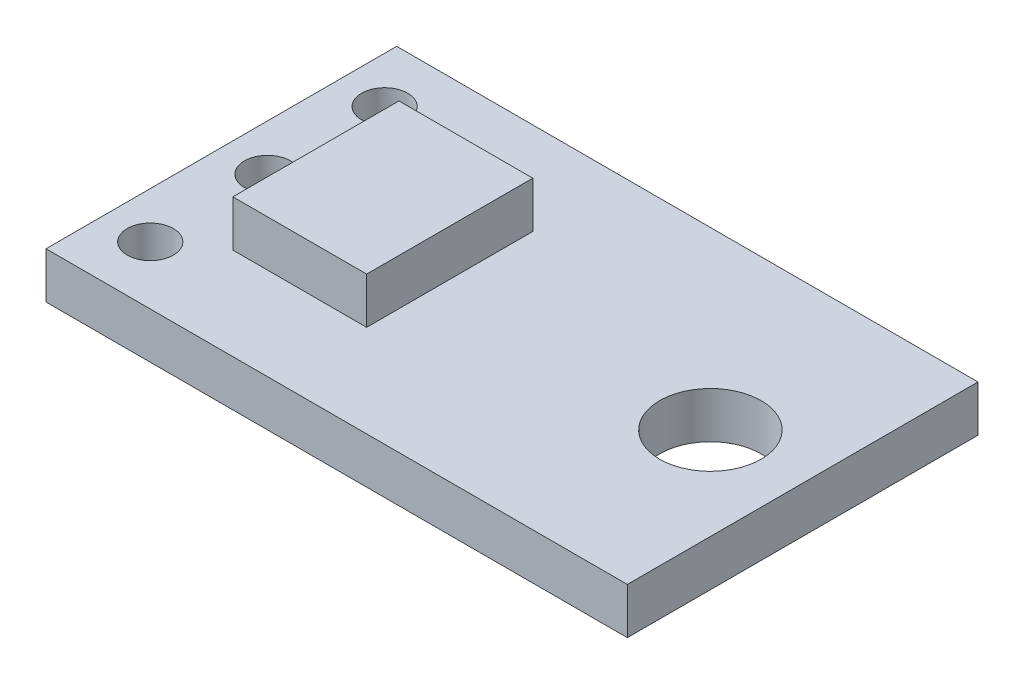
ISO-10303-21;
HEADER;
FILE_DESCRIPTION(('STEP AP214'),'2;1');
FILE_NAME('part.step','',(''),(''),'','','');
FILE_SCHEMA(('AUTOMOTIVE_DESIGN { 1 0 10303 214 1 1 1 1 }'));
ENDSEC;
DATA;
#1=APPLICATION_CONTEXT('core data for automotive mechanical design processes');
#2=APPLICATION_PROTOCOL_DEFINITION('international standard','automotive_design',2000,#1);
#3=PRODUCT_CONTEXT('',#1,'mechanical');
#4=PRODUCT('Part','Part','',(#3));
#5=PRODUCT_RELATED_PRODUCT_CATEGORY('part','',(#4));
#6=PRODUCT_DEFINITION_FORMATION('','',#4);
#7=PRODUCT_DEFINITION_CONTEXT('part definition',#1,'design');
#8=PRODUCT_DEFINITION('design','',#6,#7);
#9=PRODUCT_DEFINITION_SHAPE('','',#8);
#10=(LENGTH_UNIT() NAMED_UNIT(*) SI_UNIT(.MILLI.,.METRE.));
#11=(NAMED_UNIT(*) PLANE_ANGLE_UNIT() SI_UNIT($,.RADIAN.));
#12=(NAMED_UNIT(*) SI_UNIT($,.STERADIAN.) SOLID_ANGLE_UNIT());
#13=UNCERTAINTY_MEASURE_WITH_UNIT(LENGTH_MEASURE(1.E-05),#10,'distance_accuracy_value','');
#14=(GEOMETRIC_REPRESENTATION_CONTEXT(3) GLOBAL_UNCERTAINTY_ASSIGNED_CONTEXT((#13)) GLOBAL_UNIT_ASSIGNED_CONTEXT((#10,
#11,#12)) REPRESENTATION_CONTEXT('',''));
#15=CARTESIAN_POINT('',(0.,0.,0.));
#16=DIRECTION('',(0.,0.,1.));
#17=DIRECTION('',(1.,0.,0.));
#18=AXIS2_PLACEMENT_3D('',#15,#16,#17);
#19=CARTESIAN_POINT('',(0.,1.,0.));
#20=DIRECTION('',(0.,1.,0.));
#21=DIRECTION('',(0.,0.,1.));
#22=AXIS2_PLACEMENT_3D('',#19,#20,#21);
#23=PLANE('',#22);
#24=CARTESIAN_POINT('',(-13.9,1.,-13.3841463414634));
#25=DIRECTION('',(0.,1.,0.));
#26=DIRECTION('',(0.,0.,1.));
#27=AXIS2_PLACEMENT_3D('',#24,#25,#26);
#28=CIRCLE('',#27,1.1);
#29=CARTESIAN_POINT('',(-13.9,1.,-12.2841463414634));
#30=VERTEX_POINT('',#29);
#31=EDGE_CURVE('E136',#30,#30,#28,.T.);
#32=ORIENTED_EDGE('',*,*,#31,.F.);
#33=EDGE_LOOP('',(#32));
#34=FACE_BOUND('',#33,.T.);
#35=CARTESIAN_POINT('',(-23.5,1.,-10.8441463414634));
#36=DIRECTION('',(0.,1.,0.));
#37=DIRECTION('',(0.,0.,1.));
#38=AXIS2_PLACEMENT_3D('',#35,#36,#37);
#39=CIRCLE('',#38,0.499999999999999);
#40=CARTESIAN_POINT('',(-23.5,1.,-10.3441463414634));
#41=VERTEX_POINT('',#40);
#42=EDGE_CURVE('E135',#41,#41,#39,.T.);
#43=ORIENTED_EDGE('',*,*,#42,.F.);
#44=EDGE_LOOP('',(#43));
#45=FACE_BOUND('',#44,.T.);
#46=CARTESIAN_POINT('',(-23.5,1.,-15.9241463414634));
#47=DIRECTION('',(0.,1.,0.));
#48=DIRECTION('',(0.,0.,1.));
#49=AXIS2_PLACEMENT_3D('',#46,#47,#48);
#50=CIRCLE('',#49,0.499999999999999);
#51=CARTESIAN_POINT('',(-23.5,1.,-15.4241463414634));
#52=VERTEX_POINT('',#51);
#53=EDGE_CURVE('E143',#52,#52,#50,.T.);
#54=ORIENTED_EDGE('',*,*,#53,.F.);
#55=EDGE_LOOP('',(#54));
#56=FACE_BOUND('',#55,.T.);
#57=CARTESIAN_POINT('',(-23.5,1.,-13.3841463414634));
#58=DIRECTION('',(0.,1.,0.));
#59=DIRECTION('',(0.,0.,1.));
#60=AXIS2_PLACEMENT_3D('',#57,#58,#59);
#61=CIRCLE('',#60,0.499999999999999);
#62=CARTESIAN_POINT('',(-23.5,1.,-12.8841463414634));
#63=VERTEX_POINT('',#62);
#64=EDGE_CURVE('E149',#63,#63,#61,.T.);
#65=ORIENTED_EDGE('',*,*,#64,.F.);
#66=EDGE_LOOP('',(#65));
#67=FACE_BOUND('',#66,.T.);
#68=DIRECTION('',(0.,0.,1.));
#69=VECTOR('',#68,1.);
#70=CARTESIAN_POINT('',(-24.5,1.,-18.3841463414634));
#71=LINE('',#70,#69);
#72=CARTESIAN_POINT('',(-24.5,1.,-17.1841463414634));
#73=VERTEX_POINT('',#72);
#74=CARTESIAN_POINT('',(-24.5,1.,-9.58414634146342));
#75=VERTEX_POINT('',#74);
#76=EDGE_CURVE('E11',#73,#75,#71,.T.);
#77=ORIENTED_EDGE('',*,*,#76,.T.);
#78=DIRECTION('',(1.,0.,0.));
#79=VECTOR('',#78,1.);
#80=CARTESIAN_POINT('',(-11.9,1.,-9.58414634146342));
#81=LINE('',#80,#79);
#82=CARTESIAN_POINT('',(-11.9,1.,-9.58414634146342));
#83=VERTEX_POINT('',#82);
#84=EDGE_CURVE('E155',#75,#83,#81,.T.);
#85=ORIENTED_EDGE('',*,*,#84,.T.);
#86=DIRECTION('',(0.,0.,-1.));
#87=VECTOR('',#86,1.);
#88=CARTESIAN_POINT('',(-11.9,1.,-17.1841463414634));
#89=LINE('',#88,#87);
#90=CARTESIAN_POINT('',(-11.9,1.,-17.1841463414634));
#91=VERTEX_POINT('',#90);
#92=EDGE_CURVE('E168',#83,#91,#89,.T.);
#93=ORIENTED_EDGE('',*,*,#92,.T.);
#94=DIRECTION('',(-1.,0.,0.));
#95=VECTOR('',#94,1.);
#96=CARTESIAN_POINT('',(-24.5,1.,-17.1841463414634));
#97=LINE('',#96,#95);
#98=EDGE_CURVE('E160',#91,#73,#97,.T.);
#99=ORIENTED_EDGE('',*,*,#98,.T.);
#100=EDGE_LOOP('',(#77,#85,#93,#99));
#101=FACE_BOUND('',#100,.T.);
#102=DIRECTION('',(-1.,0.,0.));
#103=VECTOR('',#102,1.);
#104=CARTESIAN_POINT('',(-22.45,1.,-11.5841463414634));
#105=LINE('',#104,#103);
#106=CARTESIAN_POINT('',(-19.55,1.,-11.5841463414634));
#107=VERTEX_POINT('',#106);
#108=CARTESIAN_POINT('',(-22.45,1.,-11.5841463414634));
#109=VERTEX_POINT('',#108);
#110=EDGE_CURVE('E102',#107,#109,#105,.T.);
#111=ORIENTED_EDGE('',*,*,#110,.T.);
#112=DIRECTION('',(0.,0.,-1.));
#113=VECTOR('',#112,1.);
#114=CARTESIAN_POINT('',(-22.45,1.,-15.1841463414634));
#115=LINE('',#114,#113);
#116=CARTESIAN_POINT('',(-22.45,1.,-15.1841463414634));
#117=VERTEX_POINT('',#116);
#118=EDGE_CURVE('E131',#109,#117,#115,.T.);
#119=ORIENTED_EDGE('',*,*,#118,.T.);
#120=DIRECTION('',(1.,0.,0.));
#121=VECTOR('',#120,1.);
#122=CARTESIAN_POINT('',(-22.45,1.,-15.1841463414634));
#123=LINE('',#122,#121);
#124=CARTESIAN_POINT('',(-19.55,1.,-15.1841463414634));
#125=VERTEX_POINT('',#124);
#126=EDGE_CURVE('E265',#117,#125,#123,.T.);
#127=ORIENTED_EDGE('',*,*,#126,.T.);
#128=DIRECTION('',(0.,0.,1.));
#129=VECTOR('',#128,1.);
#130=CARTESIAN_POINT('',(-19.55,1.,-15.1841463414634));
#131=LINE('',#130,#129);
#132=EDGE_CURVE('E139',#125,#107,#131,.T.);
#133=ORIENTED_EDGE('',*,*,#132,.T.);
#134=EDGE_LOOP('',(#111,#119,#127,#133));
#135=FACE_BOUND('',#134,.T.);
#136=ADVANCED_FACE('F34',(#34,#45,#56,#67,#101,#135),#23,.T.);
#137=CARTESIAN_POINT('',(-24.5,1.,-18.3841463414634));
#138=DIRECTION('',(1.,0.,0.));
#139=DIRECTION('',(0.,0.,-1.));
#140=AXIS2_PLACEMENT_3D('',#137,#138,#139);
#141=PLANE('',#140);
#142=DIRECTION('',(0.,1.,0.));
#143=VECTOR('',#142,1.);
#144=CARTESIAN_POINT('',(-24.5,0.,-9.58414634146342));
#145=LINE('',#144,#143);
#146=CARTESIAN_POINT('',(-24.5,0.,-9.58414634146342));
#147=VERTEX_POINT('',#146);
#148=EDGE_CURVE('E173',#147,#75,#145,.T.);
#149=ORIENTED_EDGE('',*,*,#148,.T.);
#150=ORIENTED_EDGE('',*,*,#76,.F.);
#151=DIRECTION('',(0.,1.,0.));
#152=VECTOR('',#151,1.);
#153=CARTESIAN_POINT('',(-24.5,0.,-17.1841463414634));
#154=LINE('',#153,#152);
#155=CARTESIAN_POINT('',(-24.5,0.,-17.1841463414634));
#156=VERTEX_POINT('',#155);
#157=EDGE_CURVE('E176',#156,#73,#154,.T.);
#158=ORIENTED_EDGE('',*,*,#157,.F.);
#159=DIRECTION('',(0.,0.,1.));
#160=VECTOR('',#159,1.);
#161=CARTESIAN_POINT('',(-24.5,0.,-18.3841463414634));
#162=LINE('',#161,#160);
#163=EDGE_CURVE('E38',#156,#147,#162,.T.);
#164=ORIENTED_EDGE('',*,*,#163,.T.);
#165=EDGE_LOOP('',(#149,#150,#158,#164));
#166=FACE_BOUND('',#165,.T.);
#167=ADVANCED_FACE('F36',(#166),#141,.F.);
#168=CARTESIAN_POINT('',(0.,0.,0.));
#169=DIRECTION('',(0.,1.,0.));
#170=DIRECTION('',(0.,0.,1.));
#171=AXIS2_PLACEMENT_3D('',#168,#169,#170);
#172=PLANE('',#171);
#173=CARTESIAN_POINT('',(-13.9,0.,-13.3841463414634));
#174=DIRECTION('',(0.,1.,0.));
#175=DIRECTION('',(0.,0.,1.));
#176=AXIS2_PLACEMENT_3D('',#173,#174,#175);
#177=CIRCLE('',#176,1.1);
#178=CARTESIAN_POINT('',(-13.9,0.,-12.2841463414634));
#179=VERTEX_POINT('',#178);
#180=EDGE_CURVE('E132',#179,#179,#177,.T.);
#181=ORIENTED_EDGE('',*,*,#180,.T.);
#182=EDGE_LOOP('',(#181));
#183=FACE_BOUND('',#182,.T.);
#184=CARTESIAN_POINT('',(-23.5,0.,-10.8441463414634));
#185=DIRECTION('',(0.,1.,0.));
#186=DIRECTION('',(0.,0.,1.));
#187=AXIS2_PLACEMENT_3D('',#184,#185,#186);
#188=CIRCLE('',#187,0.499999999999999);
#189=CARTESIAN_POINT('',(-23.5,0.,-10.3441463414634));
#190=VERTEX_POINT('',#189);
#191=EDGE_CURVE('E140',#190,#190,#188,.T.);
#192=ORIENTED_EDGE('',*,*,#191,.T.);
#193=EDGE_LOOP('',(#192));
#194=FACE_BOUND('',#193,.T.);
#195=CARTESIAN_POINT('',(-23.5,0.,-15.9241463414634));
#196=DIRECTION('',(0.,1.,0.));
#197=DIRECTION('',(0.,0.,1.));
#198=AXIS2_PLACEMENT_3D('',#195,#196,#197);
#199=CIRCLE('',#198,0.499999999999999);
#200=CARTESIAN_POINT('',(-23.5,0.,-15.4241463414634));
#201=VERTEX_POINT('',#200);
#202=EDGE_CURVE('E146',#201,#201,#199,.T.);
#203=ORIENTED_EDGE('',*,*,#202,.T.);
#204=EDGE_LOOP('',(#203));
#205=FACE_BOUND('',#204,.T.);
#206=CARTESIAN_POINT('',(-23.5,0.,-13.3841463414634));
#207=DIRECTION('',(0.,1.,0.));
#208=DIRECTION('',(0.,0.,1.));
#209=AXIS2_PLACEMENT_3D('',#206,#207,#208);
#210=CIRCLE('',#209,0.499999999999999);
#211=CARTESIAN_POINT('',(-23.5,0.,-12.8841463414634));
#212=VERTEX_POINT('',#211);
#213=EDGE_CURVE('E152',#212,#212,#210,.T.);
#214=ORIENTED_EDGE('',*,*,#213,.T.);
#215=EDGE_LOOP('',(#214));
#216=FACE_BOUND('',#215,.T.);
#217=DIRECTION('',(1.,0.,0.));
#218=VECTOR('',#217,1.);
#219=CARTESIAN_POINT('',(-11.9,0.,-9.58414634146342));
#220=LINE('',#219,#218);
#221=CARTESIAN_POINT('',(-11.9,0.,-9.58414634146342));
#222=VERTEX_POINT('',#221);
#223=EDGE_CURVE('E57',#147,#222,#220,.T.);
#224=ORIENTED_EDGE('',*,*,#223,.F.);
#225=ORIENTED_EDGE('',*,*,#163,.F.);
#226=DIRECTION('',(-1.,0.,0.));
#227=VECTOR('',#226,1.);
#228=CARTESIAN_POINT('',(-24.5,0.,-17.1841463414634));
#229=LINE('',#228,#227);
#230=CARTESIAN_POINT('',(-11.9,0.,-17.1841463414634));
#231=VERTEX_POINT('',#230);
#232=EDGE_CURVE('E163',#231,#156,#229,.T.);
#233=ORIENTED_EDGE('',*,*,#232,.F.);
#234=DIRECTION('',(0.,0.,-1.));
#235=VECTOR('',#234,1.);
#236=CARTESIAN_POINT('',(-11.9,0.,-17.1841463414634));
#237=LINE('',#236,#235);
#238=EDGE_CURVE('E159',#222,#231,#237,.T.);
#239=ORIENTED_EDGE('',*,*,#238,.F.);
#240=EDGE_LOOP('',(#224,#225,#233,#239));
#241=FACE_BOUND('',#240,.T.);
#242=ADVANCED_FACE('F194',(#183,#194,#205,#216,#241),#172,.F.);
#243=CARTESIAN_POINT('',(-11.9,0.,-9.58414634146342));
#244=DIRECTION('',(0.,0.,1.));
#245=DIRECTION('',(1.,0.,0.));
#246=AXIS2_PLACEMENT_3D('',#243,#244,#245);
#247=PLANE('',#246);
#248=ORIENTED_EDGE('',*,*,#84,.F.);
#249=ORIENTED_EDGE('',*,*,#148,.F.);
#250=ORIENTED_EDGE('',*,*,#223,.T.);
#251=DIRECTION('',(0.,1.,0.));
#252=VECTOR('',#251,1.);
#253=CARTESIAN_POINT('',(-11.9,0.,-9.58414634146342));
#254=LINE('',#253,#252);
#255=EDGE_CURVE('E165',#222,#83,#254,.T.);
#256=ORIENTED_EDGE('',*,*,#255,.T.);
#257=EDGE_LOOP('',(#248,#249,#250,#256));
#258=FACE_BOUND('',#257,.T.);
#259=ADVANCED_FACE('F181',(#258),#247,.T.);
#260=CARTESIAN_POINT('',(-24.5,0.,-17.1841463414634));
#261=DIRECTION('',(0.,0.,-1.));
#262=DIRECTION('',(-1.,0.,0.));
#263=AXIS2_PLACEMENT_3D('',#260,#261,#262);
#264=PLANE('',#263);
#265=ORIENTED_EDGE('',*,*,#98,.F.);
#266=DIRECTION('',(0.,1.,0.));
#267=VECTOR('',#266,1.);
#268=CARTESIAN_POINT('',(-11.9,0.,-17.1841463414634));
#269=LINE('',#268,#267);
#270=EDGE_CURVE('E178',#231,#91,#269,.T.);
#271=ORIENTED_EDGE('',*,*,#270,.F.);
#272=ORIENTED_EDGE('',*,*,#232,.T.);
#273=ORIENTED_EDGE('',*,*,#157,.T.);
#274=EDGE_LOOP('',(#265,#271,#272,#273));
#275=FACE_BOUND('',#274,.T.);
#276=ADVANCED_FACE('F197',(#275),#264,.T.);
#277=CARTESIAN_POINT('',(-11.9,0.,-17.1841463414634));
#278=DIRECTION('',(1.,0.,0.));
#279=DIRECTION('',(0.,0.,-1.));
#280=AXIS2_PLACEMENT_3D('',#277,#278,#279);
#281=PLANE('',#280);
#282=ORIENTED_EDGE('',*,*,#92,.F.);
#283=ORIENTED_EDGE('',*,*,#255,.F.);
#284=ORIENTED_EDGE('',*,*,#238,.T.);
#285=ORIENTED_EDGE('',*,*,#270,.T.);
#286=EDGE_LOOP('',(#282,#283,#284,#285));
#287=FACE_BOUND('',#286,.T.);
#288=ADVANCED_FACE('F184',(#287),#281,.T.);
#289=CARTESIAN_POINT('',(-23.5,0.,-13.3841463414634));
#290=DIRECTION('',(0.,1.,0.));
#291=DIRECTION('',(0.,0.,1.));
#292=AXIS2_PLACEMENT_3D('',#289,#290,#291);
#293=CYLINDRICAL_SURFACE('',#292,0.499999999999999);
#294=ORIENTED_EDGE('',*,*,#213,.F.);
#295=EDGE_LOOP('',(#294));
#296=FACE_BOUND('',#295,.T.);
#297=ORIENTED_EDGE('',*,*,#64,.T.);
#298=EDGE_LOOP('',(#297));
#299=FACE_BOUND('',#298,.T.);
#300=ADVANCED_FACE('F204',(#296,#299),#293,.F.);
#301=CARTESIAN_POINT('',(-23.5,0.,-15.9241463414634));
#302=DIRECTION('',(0.,1.,0.));
#303=DIRECTION('',(0.,0.,1.));
#304=AXIS2_PLACEMENT_3D('',#301,#302,#303);
#305=CYLINDRICAL_SURFACE('',#304,0.499999999999999);
#306=ORIENTED_EDGE('',*,*,#202,.F.);
#307=EDGE_LOOP('',(#306));
#308=FACE_BOUND('',#307,.T.);
#309=ORIENTED_EDGE('',*,*,#53,.T.);
#310=EDGE_LOOP('',(#309));
#311=FACE_BOUND('',#310,.T.);
#312=ADVANCED_FACE('F234',(#308,#311),#305,.F.);
#313=CARTESIAN_POINT('',(-23.5,0.,-10.8441463414634));
#314=DIRECTION('',(0.,1.,0.));
#315=DIRECTION('',(0.,0.,1.));
#316=AXIS2_PLACEMENT_3D('',#313,#314,#315);
#317=CYLINDRICAL_SURFACE('',#316,0.499999999999999);
#318=ORIENTED_EDGE('',*,*,#191,.F.);
#319=EDGE_LOOP('',(#318));
#320=FACE_BOUND('',#319,.T.);
#321=ORIENTED_EDGE('',*,*,#42,.T.);
#322=EDGE_LOOP('',(#321));
#323=FACE_BOUND('',#322,.T.);
#324=ADVANCED_FACE('F239',(#320,#323),#317,.F.);
#325=CARTESIAN_POINT('',(-13.9,0.,-13.3841463414634));
#326=DIRECTION('',(0.,1.,0.));
#327=DIRECTION('',(0.,0.,1.));
#328=AXIS2_PLACEMENT_3D('',#325,#326,#327);
#329=CYLINDRICAL_SURFACE('',#328,1.1);
#330=ORIENTED_EDGE('',*,*,#180,.F.);
#331=EDGE_LOOP('',(#330));
#332=FACE_BOUND('',#331,.T.);
#333=ORIENTED_EDGE('',*,*,#31,.T.);
#334=EDGE_LOOP('',(#333));
#335=FACE_BOUND('',#334,.T.);
#336=ADVANCED_FACE('F245',(#332,#335),#329,.F.);
#337=CARTESIAN_POINT('',(-22.45,-5.05602516593319,-11.5841463414634));
#338=DIRECTION('',(0.,0.,1.));
#339=DIRECTION('',(1.,0.,0.));
#340=AXIS2_PLACEMENT_3D('',#337,#338,#339);
#341=PLANE('',#340);
#342=DIRECTION('',(0.,1.,0.));
#343=VECTOR('',#342,1.);
#344=CARTESIAN_POINT('',(-19.55,-5.05602516593319,-11.5841463414634));
#345=LINE('',#344,#343);
#346=CARTESIAN_POINT('',(-19.55,2.,-11.5841463414634));
#347=VERTEX_POINT('',#346);
#348=EDGE_CURVE('E98',#107,#347,#345,.T.);
#349=ORIENTED_EDGE('',*,*,#348,.T.);
#350=DIRECTION('',(1.,0.,0.));
#351=VECTOR('',#350,1.);
#352=CARTESIAN_POINT('',(-22.45,2.,-11.5841463414634));
#353=LINE('',#352,#351);
#354=CARTESIAN_POINT('',(-22.45,2.,-11.5841463414634));
#355=VERTEX_POINT('',#354);
#356=EDGE_CURVE('E49',#355,#347,#353,.T.);
#357=ORIENTED_EDGE('',*,*,#356,.F.);
#358=DIRECTION('',(0.,1.,0.));
#359=VECTOR('',#358,1.);
#360=CARTESIAN_POINT('',(-22.45,-5.05602516593319,-11.5841463414634));
#361=LINE('',#360,#359);
#362=EDGE_CURVE('E106',#109,#355,#361,.T.);
#363=ORIENTED_EDGE('',*,*,#362,.F.);
#364=ORIENTED_EDGE('',*,*,#110,.F.);
#365=EDGE_LOOP('',(#349,#357,#363,#364));
#366=FACE_BOUND('',#365,.T.);
#367=ADVANCED_FACE('F100',(#366),#341,.T.);
#368=CARTESIAN_POINT('',(-19.55,-5.05602516593319,-15.1841463414634));
#369=DIRECTION('',(1.,0.,0.));
#370=DIRECTION('',(0.,0.,-1.));
#371=AXIS2_PLACEMENT_3D('',#368,#369,#370);
#372=PLANE('',#371);
#373=DIRECTION('',(0.,1.,0.));
#374=VECTOR('',#373,1.);
#375=CARTESIAN_POINT('',(-19.55,-5.05602516593319,-15.1841463414634));
#376=LINE('',#375,#374);
#377=CARTESIAN_POINT('',(-19.55,2.,-15.1841463414634));
#378=VERTEX_POINT('',#377);
#379=EDGE_CURVE('E105',#125,#378,#376,.T.);
#380=ORIENTED_EDGE('',*,*,#379,.T.);
#381=DIRECTION('',(0.,0.,-1.));
#382=VECTOR('',#381,1.);
#383=CARTESIAN_POINT('',(-19.55,2.,-15.1841463414634));
#384=LINE('',#383,#382);
#385=EDGE_CURVE('E109',#347,#378,#384,.T.);
#386=ORIENTED_EDGE('',*,*,#385,.F.);
#387=ORIENTED_EDGE('',*,*,#348,.F.);
#388=ORIENTED_EDGE('',*,*,#132,.F.);
#389=EDGE_LOOP('',(#380,#386,#387,#388));
#390=FACE_BOUND('',#389,.T.);
#391=ADVANCED_FACE('F110',(#390),#372,.T.);
#392=CARTESIAN_POINT('',(-22.45,-5.05602516593319,-15.1841463414634));
#393=DIRECTION('',(0.,0.,-1.));
#394=DIRECTION('',(-1.,0.,0.));
#395=AXIS2_PLACEMENT_3D('',#392,#393,#394);
#396=PLANE('',#395);
#397=DIRECTION('',(0.,1.,0.));
#398=VECTOR('',#397,1.);
#399=CARTESIAN_POINT('',(-22.45,-5.05602516593319,-15.1841463414634));
#400=LINE('',#399,#398);
#401=CARTESIAN_POINT('',(-22.45,2.,-15.1841463414634));
#402=VERTEX_POINT('',#401);
#403=EDGE_CURVE('E126',#117,#402,#400,.T.);
#404=ORIENTED_EDGE('',*,*,#403,.T.);
#405=DIRECTION('',(-1.,0.,0.));
#406=VECTOR('',#405,1.);
#407=CARTESIAN_POINT('',(-22.45,2.,-15.1841463414634));
#408=LINE('',#407,#406);
#409=EDGE_CURVE('E115',#378,#402,#408,.T.);
#410=ORIENTED_EDGE('',*,*,#409,.F.);
#411=ORIENTED_EDGE('',*,*,#379,.F.);
#412=ORIENTED_EDGE('',*,*,#126,.F.);
#413=EDGE_LOOP('',(#404,#410,#411,#412));
#414=FACE_BOUND('',#413,.T.);
#415=ADVANCED_FACE('F253',(#414),#396,.T.);
#416=CARTESIAN_POINT('',(-22.45,-5.05602516593319,-15.1841463414634));
#417=DIRECTION('',(-1.,0.,0.));
#418=DIRECTION('',(0.,0.,1.));
#419=AXIS2_PLACEMENT_3D('',#416,#417,#418);
#420=PLANE('',#419);
#421=ORIENTED_EDGE('',*,*,#362,.T.);
#422=DIRECTION('',(0.,0.,1.));
#423=VECTOR('',#422,1.);
#424=CARTESIAN_POINT('',(-22.45,2.,-15.1841463414634));
#425=LINE('',#424,#423);
#426=EDGE_CURVE('E120',#402,#355,#425,.T.);
#427=ORIENTED_EDGE('',*,*,#426,.F.);
#428=ORIENTED_EDGE('',*,*,#403,.F.);
#429=ORIENTED_EDGE('',*,*,#118,.F.);
#430=EDGE_LOOP('',(#421,#427,#428,#429));
#431=FACE_BOUND('',#430,.T.);
#432=ADVANCED_FACE('F250',(#431),#420,.T.);
#433=CARTESIAN_POINT('',(0.,2.,0.));
#434=DIRECTION('',(0.,-1.,0.));
#435=DIRECTION('',(0.,0.,-1.));
#436=AXIS2_PLACEMENT_3D('',#433,#434,#435);
#437=PLANE('',#436);
#438=ORIENTED_EDGE('',*,*,#356,.T.);
#439=ORIENTED_EDGE('',*,*,#385,.T.);
#440=ORIENTED_EDGE('',*,*,#409,.T.);
#441=ORIENTED_EDGE('',*,*,#426,.T.);
#442=EDGE_LOOP('',(#438,#439,#440,#441));
#443=FACE_BOUND('',#442,.T.);
#444=ADVANCED_FACE('F118',(#443),#437,.F.);
#445=CLOSED_SHELL('',(#136,#167,#242,#259,#276,#288,#300,#312,#324,#336,#367,#391,#415,#432,#444));
#446=MANIFOLD_SOLID_BREP('B2',#445);
#447=ADVANCED_BREP_SHAPE_REPRESENTATION('',(#18,#446),#14);
#448=SHAPE_DEFINITION_REPRESENTATION(#9,#447);
ENDSEC;
END-ISO-10303-21;
